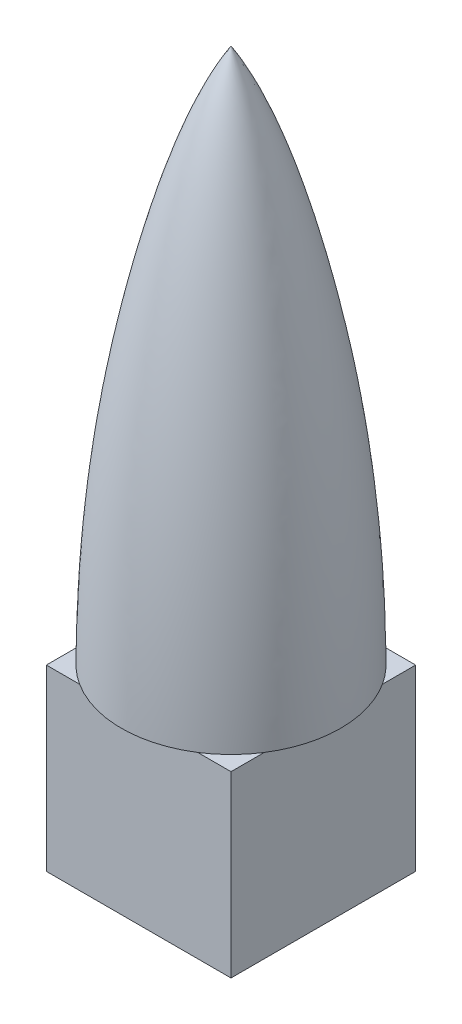
ISO-10303-21;
HEADER;
FILE_DESCRIPTION(('STEP AP214'),'2;1');
FILE_NAME('part.step','',(''),(''),'','','');
FILE_SCHEMA(('AUTOMOTIVE_DESIGN { 1 0 10303 214 1 1 1 1 }'));
ENDSEC;
DATA;
#1=APPLICATION_CONTEXT('core data for automotive mechanical design processes');
#2=APPLICATION_PROTOCOL_DEFINITION('international standard','automotive_design',2000,#1);
#3=PRODUCT_CONTEXT('',#1,'mechanical');
#4=PRODUCT('Part','Part','',(#3));
#5=PRODUCT_RELATED_PRODUCT_CATEGORY('part','',(#4));
#6=PRODUCT_DEFINITION_FORMATION('','',#4);
#7=PRODUCT_DEFINITION_CONTEXT('part definition',#1,'design');
#8=PRODUCT_DEFINITION('design','',#6,#7);
#9=PRODUCT_DEFINITION_SHAPE('','',#8);
#10=(LENGTH_UNIT() NAMED_UNIT(*) SI_UNIT(.MILLI.,.METRE.));
#11=(NAMED_UNIT(*) PLANE_ANGLE_UNIT() SI_UNIT($,.RADIAN.));
#12=(NAMED_UNIT(*) SI_UNIT($,.STERADIAN.) SOLID_ANGLE_UNIT());
#13=UNCERTAINTY_MEASURE_WITH_UNIT(LENGTH_MEASURE(1.E-05),#10,'distance_accuracy_value','');
#14=(GEOMETRIC_REPRESENTATION_CONTEXT(3) GLOBAL_UNCERTAINTY_ASSIGNED_CONTEXT((#13)) GLOBAL_UNIT_ASSIGNED_CONTEXT((#10,
#11,#12)) REPRESENTATION_CONTEXT('',''));
#15=CARTESIAN_POINT('',(0.,0.,0.));
#16=DIRECTION('',(0.,0.,1.));
#17=DIRECTION('',(1.,0.,0.));
#18=AXIS2_PLACEMENT_3D('',#15,#16,#17);
#19=CARTESIAN_POINT('',(0.,15.,0.));
#20=DIRECTION('',(0.,-1.,0.));
#21=DIRECTION('',(0.,0.,-1.));
#22=AXIS2_PLACEMENT_3D('',#19,#20,#21);
#23=PLANE('',#22);
#24=DIRECTION('',(0.,0.,-1.));
#25=VECTOR('',#24,1.);
#26=CARTESIAN_POINT('',(7.75,15.,7.75));
#27=LINE('',#26,#25);
#28=CARTESIAN_POINT('',(7.75,15.,7.75));
#29=VERTEX_POINT('',#28);
#30=CARTESIAN_POINT('',(7.75,15.,4.95756996924902));
#31=VERTEX_POINT('',#30);
#32=EDGE_CURVE('E128',#29,#31,#27,.T.);
#33=ORIENTED_EDGE('',*,*,#32,.T.);
#34=CARTESIAN_POINT('',(0.,15.,0.));
#35=DIRECTION('',(0.,-1.,0.));
#36=DIRECTION('',(1.,0.,0.));
#37=AXIS2_PLACEMENT_3D('',#34,#35,#36);
#38=CIRCLE('',#37,9.19999999999998);
#39=CARTESIAN_POINT('',(4.95756996924902,15.,7.75));
#40=VERTEX_POINT('',#39);
#41=EDGE_CURVE('E118',#31,#40,#38,.T.);
#42=ORIENTED_EDGE('',*,*,#41,.T.);
#43=DIRECTION('',(1.,0.,0.));
#44=VECTOR('',#43,1.);
#45=CARTESIAN_POINT('',(-7.75,15.,7.75));
#46=LINE('',#45,#44);
#47=EDGE_CURVE('E58',#40,#29,#46,.T.);
#48=ORIENTED_EDGE('',*,*,#47,.T.);
#49=EDGE_LOOP('',(#33,#42,#48));
#50=FACE_BOUND('',#49,.T.);
#51=ADVANCED_FACE('F33',(#50),#23,.F.);
#52=CARTESIAN_POINT('',(-7.75,15.,7.75));
#53=VERTEX_POINT('',#52);
#54=CARTESIAN_POINT('',(-4.95756996924901,15.,7.75));
#55=VERTEX_POINT('',#54);
#56=EDGE_CURVE('E145',#53,#55,#46,.T.);
#57=ORIENTED_EDGE('',*,*,#56,.T.);
#58=CARTESIAN_POINT('',(0.,15.,0.));
#59=DIRECTION('',(0.,-1.,0.));
#60=DIRECTION('',(1.,0.,0.));
#61=AXIS2_PLACEMENT_3D('',#58,#59,#60);
#62=CIRCLE('',#61,9.19999999999998);
#63=CARTESIAN_POINT('',(-7.75,15.,4.95756996924901));
#64=VERTEX_POINT('',#63);
#65=EDGE_CURVE('E11',#55,#64,#62,.T.);
#66=ORIENTED_EDGE('',*,*,#65,.T.);
#67=DIRECTION('',(0.,0.,1.));
#68=VECTOR('',#67,1.);
#69=CARTESIAN_POINT('',(-7.75,15.,7.75));
#70=LINE('',#69,#68);
#71=EDGE_CURVE('E172',#64,#53,#70,.T.);
#72=ORIENTED_EDGE('',*,*,#71,.T.);
#73=EDGE_LOOP('',(#57,#66,#72));
#74=FACE_BOUND('',#73,.T.);
#75=ADVANCED_FACE('F209',(#74),#23,.F.);
#76=CARTESIAN_POINT('',(-7.75,15.,-7.75));
#77=VERTEX_POINT('',#76);
#78=CARTESIAN_POINT('',(-7.75,15.,-4.95756996924901));
#79=VERTEX_POINT('',#78);
#80=EDGE_CURVE('E159',#77,#79,#70,.T.);
#81=ORIENTED_EDGE('',*,*,#80,.T.);
#82=CARTESIAN_POINT('',(-4.95756996924901,15.,-7.75));
#83=VERTEX_POINT('',#82);
#84=EDGE_CURVE('E42',#79,#83,#62,.T.);
#85=ORIENTED_EDGE('',*,*,#84,.T.);
#86=DIRECTION('',(-1.,0.,0.));
#87=VECTOR('',#86,1.);
#88=CARTESIAN_POINT('',(-7.75,15.,-7.75));
#89=LINE('',#88,#87);
#90=EDGE_CURVE('E132',#83,#77,#89,.T.);
#91=ORIENTED_EDGE('',*,*,#90,.T.);
#92=EDGE_LOOP('',(#81,#85,#91));
#93=FACE_BOUND('',#92,.T.);
#94=ADVANCED_FACE('F156',(#93),#23,.F.);
#95=CARTESIAN_POINT('',(7.75,15.,7.75));
#96=DIRECTION('',(-1.,0.,0.));
#97=DIRECTION('',(0.,0.,1.));
#98=AXIS2_PLACEMENT_3D('',#95,#96,#97);
#99=PLANE('',#98);
#100=DIRECTION('',(0.,0.,-1.));
#101=VECTOR('',#100,1.);
#102=CARTESIAN_POINT('',(7.75,0.,7.75));
#103=LINE('',#102,#101);
#104=CARTESIAN_POINT('',(7.75,0.,7.75));
#105=VERTEX_POINT('',#104);
#106=CARTESIAN_POINT('',(7.75,0.,-7.75));
#107=VERTEX_POINT('',#106);
#108=EDGE_CURVE('E122',#105,#107,#103,.T.);
#109=ORIENTED_EDGE('',*,*,#108,.T.);
#110=DIRECTION('',(0.,-1.,0.));
#111=VECTOR('',#110,1.);
#112=CARTESIAN_POINT('',(7.75,15.,-7.75));
#113=LINE('',#112,#111);
#114=CARTESIAN_POINT('',(7.75,15.,-7.75));
#115=VERTEX_POINT('',#114);
#116=EDGE_CURVE('E149',#115,#107,#113,.T.);
#117=ORIENTED_EDGE('',*,*,#116,.F.);
#118=CARTESIAN_POINT('',(7.75,15.,-4.95756996924902));
#119=VERTEX_POINT('',#118);
#120=EDGE_CURVE('E88',#119,#115,#27,.T.);
#121=ORIENTED_EDGE('',*,*,#120,.F.);
#122=EDGE_CURVE('E126',#31,#119,#27,.T.);
#123=ORIENTED_EDGE('',*,*,#122,.F.);
#124=ORIENTED_EDGE('',*,*,#32,.F.);
#125=DIRECTION('',(0.,-1.,0.));
#126=VECTOR('',#125,1.);
#127=CARTESIAN_POINT('',(7.75,15.,7.75));
#128=LINE('',#127,#126);
#129=EDGE_CURVE('E142',#29,#105,#128,.T.);
#130=ORIENTED_EDGE('',*,*,#129,.T.);
#131=EDGE_LOOP('',(#109,#117,#121,#123,#124,#130));
#132=FACE_BOUND('',#131,.T.);
#133=ADVANCED_FACE('F35',(#132),#99,.F.);
#134=CARTESIAN_POINT('',(-7.75,15.,-7.75));
#135=DIRECTION('',(0.,0.,1.));
#136=DIRECTION('',(1.,0.,0.));
#137=AXIS2_PLACEMENT_3D('',#134,#135,#136);
#138=PLANE('',#137);
#139=DIRECTION('',(-1.,0.,0.));
#140=VECTOR('',#139,1.);
#141=CARTESIAN_POINT('',(-7.75,0.,-7.75));
#142=LINE('',#141,#140);
#143=CARTESIAN_POINT('',(-7.75,0.,-7.75));
#144=VERTEX_POINT('',#143);
#145=EDGE_CURVE('E138',#107,#144,#142,.T.);
#146=ORIENTED_EDGE('',*,*,#145,.T.);
#147=DIRECTION('',(0.,-1.,0.));
#148=VECTOR('',#147,1.);
#149=CARTESIAN_POINT('',(-7.75,15.,-7.75));
#150=LINE('',#149,#148);
#151=EDGE_CURVE('E147',#77,#144,#150,.T.);
#152=ORIENTED_EDGE('',*,*,#151,.F.);
#153=ORIENTED_EDGE('',*,*,#90,.F.);
#154=CARTESIAN_POINT('',(4.95756996924902,15.,-7.75));
#155=VERTEX_POINT('',#154);
#156=EDGE_CURVE('E133',#155,#83,#89,.T.);
#157=ORIENTED_EDGE('',*,*,#156,.F.);
#158=EDGE_CURVE('E135',#115,#155,#89,.T.);
#159=ORIENTED_EDGE('',*,*,#158,.F.);
#160=ORIENTED_EDGE('',*,*,#116,.T.);
#161=EDGE_LOOP('',(#146,#152,#153,#157,#159,#160));
#162=FACE_BOUND('',#161,.T.);
#163=ADVANCED_FACE('F164',(#162),#138,.F.);
#164=CARTESIAN_POINT('',(-7.75,15.,7.75));
#165=DIRECTION('',(1.,0.,0.));
#166=DIRECTION('',(0.,0.,-1.));
#167=AXIS2_PLACEMENT_3D('',#164,#165,#166);
#168=PLANE('',#167);
#169=DIRECTION('',(0.,0.,1.));
#170=VECTOR('',#169,1.);
#171=CARTESIAN_POINT('',(-7.75,0.,7.75));
#172=LINE('',#171,#170);
#173=CARTESIAN_POINT('',(-7.75,0.,7.75));
#174=VERTEX_POINT('',#173);
#175=EDGE_CURVE('E136',#144,#174,#172,.T.);
#176=ORIENTED_EDGE('',*,*,#175,.T.);
#177=DIRECTION('',(0.,-1.,0.));
#178=VECTOR('',#177,1.);
#179=CARTESIAN_POINT('',(-7.75,15.,7.75));
#180=LINE('',#179,#178);
#181=EDGE_CURVE('E144',#53,#174,#180,.T.);
#182=ORIENTED_EDGE('',*,*,#181,.F.);
#183=ORIENTED_EDGE('',*,*,#71,.F.);
#184=EDGE_CURVE('E170',#79,#64,#70,.T.);
#185=ORIENTED_EDGE('',*,*,#184,.F.);
#186=ORIENTED_EDGE('',*,*,#80,.F.);
#187=ORIENTED_EDGE('',*,*,#151,.T.);
#188=EDGE_LOOP('',(#176,#182,#183,#185,#186,#187));
#189=FACE_BOUND('',#188,.T.);
#190=ADVANCED_FACE('F168',(#189),#168,.F.);
#191=CARTESIAN_POINT('',(-7.75,15.,7.75));
#192=DIRECTION('',(0.,0.,-1.));
#193=DIRECTION('',(-1.,0.,0.));
#194=AXIS2_PLACEMENT_3D('',#191,#192,#193);
#195=PLANE('',#194);
#196=DIRECTION('',(1.,0.,0.));
#197=VECTOR('',#196,1.);
#198=CARTESIAN_POINT('',(-7.75,0.,7.75));
#199=LINE('',#198,#197);
#200=EDGE_CURVE('E80',#174,#105,#199,.T.);
#201=ORIENTED_EDGE('',*,*,#200,.T.);
#202=ORIENTED_EDGE('',*,*,#129,.F.);
#203=ORIENTED_EDGE('',*,*,#47,.F.);
#204=EDGE_CURVE('E173',#55,#40,#46,.T.);
#205=ORIENTED_EDGE('',*,*,#204,.F.);
#206=ORIENTED_EDGE('',*,*,#56,.F.);
#207=ORIENTED_EDGE('',*,*,#181,.T.);
#208=EDGE_LOOP('',(#201,#202,#203,#205,#206,#207));
#209=FACE_BOUND('',#208,.T.);
#210=ADVANCED_FACE('F197',(#209),#195,.F.);
#211=ORIENTED_EDGE('',*,*,#158,.T.);
#212=EDGE_CURVE('E37',#155,#119,#62,.T.);
#213=ORIENTED_EDGE('',*,*,#212,.T.);
#214=ORIENTED_EDGE('',*,*,#120,.T.);
#215=EDGE_LOOP('',(#211,#213,#214));
#216=FACE_BOUND('',#215,.T.);
#217=ADVANCED_FACE('F193',(#216),#23,.F.);
#218=CARTESIAN_POINT('',(0.,0.,0.));
#219=DIRECTION('',(0.,-1.,0.));
#220=DIRECTION('',(0.,0.,-1.));
#221=AXIS2_PLACEMENT_3D('',#218,#219,#220);
#222=PLANE('',#221);
#223=ORIENTED_EDGE('',*,*,#108,.F.);
#224=ORIENTED_EDGE('',*,*,#200,.F.);
#225=ORIENTED_EDGE('',*,*,#175,.F.);
#226=ORIENTED_EDGE('',*,*,#145,.F.);
#227=EDGE_LOOP('',(#223,#224,#225,#226));
#228=FACE_BOUND('',#227,.T.);
#229=ADVANCED_FACE('F196',(#228),#222,.T.);
#230=CARTESIAN_POINT('',(9.19999999999999,15.,0.));
#231=DIRECTION('',(0.,-1.,0.));
#232=DIRECTION('',(1.,0.,0.));
#233=AXIS2_PLACEMENT_3D('',#230,#231,#232);
#234=PLANE('',#233);
#235=ORIENTED_EDGE('',*,*,#122,.T.);
#236=EDGE_CURVE('E49',#119,#31,#38,.T.);
#237=ORIENTED_EDGE('',*,*,#236,.T.);
#238=EDGE_LOOP('',(#235,#237));
#239=FACE_BOUND('',#238,.T.);
#240=ADVANCED_FACE('F192',(#239),#234,.T.);
#241=ORIENTED_EDGE('',*,*,#156,.T.);
#242=EDGE_CURVE('E181',#83,#155,#38,.T.);
#243=ORIENTED_EDGE('',*,*,#242,.T.);
#244=EDGE_LOOP('',(#241,#243));
#245=FACE_BOUND('',#244,.T.);
#246=ADVANCED_FACE('F180',(#245),#234,.T.);
#247=ORIENTED_EDGE('',*,*,#184,.T.);
#248=EDGE_CURVE('E182',#64,#79,#38,.T.);
#249=ORIENTED_EDGE('',*,*,#248,.T.);
#250=EDGE_LOOP('',(#247,#249));
#251=FACE_BOUND('',#250,.T.);
#252=ADVANCED_FACE('F222',(#251),#234,.T.);
#253=ORIENTED_EDGE('',*,*,#204,.T.);
#254=EDGE_CURVE('E121',#40,#55,#38,.T.);
#255=ORIENTED_EDGE('',*,*,#254,.T.);
#256=EDGE_LOOP('',(#253,#255));
#257=FACE_BOUND('',#256,.T.);
#258=ADVANCED_FACE('F115',(#257),#234,.T.);
#259=CARTESIAN_POINT('',(9.19999999999999,15.,0.));
#260=CARTESIAN_POINT('',(9.15224899524364,24.6909873660194,0.));
#261=CARTESIAN_POINT('',(8.00981736964998,34.8825172622735,0.));
#262=CARTESIAN_POINT('',(4.24723586984686,50.5068159575728,0.));
#263=CARTESIAN_POINT('',(2.01677807120108,56.805895623584,0.));
#264=CARTESIAN_POINT('',(0.,60.,0.));
#265=B_SPLINE_CURVE_WITH_KNOTS('',3,(#259,#260,#261,#262,#263,#264),.UNSPECIFIED.,.F.,.F.,(4,1,
1,4),(0.,0.565414982236912,0.665414982236912,1.),.UNSPECIFIED.);
#266=CARTESIAN_POINT('',(0.,15.,0.));
#267=DIRECTION('',(0.,-1.,0.));
#268=AXIS1_PLACEMENT('',#266,#267);
#269=SURFACE_OF_REVOLUTION('',#265,#268);
#270=CARTESIAN_POINT('',(0.,60.,0.));
#271=VERTEX_POINT('',#270);
#272=VERTEX_LOOP('',#271);
#273=FACE_BOUND('',#272,.T.);
#274=ORIENTED_EDGE('',*,*,#41,.F.);
#275=ORIENTED_EDGE('',*,*,#236,.F.);
#276=ORIENTED_EDGE('',*,*,#212,.F.);
#277=ORIENTED_EDGE('',*,*,#242,.F.);
#278=ORIENTED_EDGE('',*,*,#84,.F.);
#279=ORIENTED_EDGE('',*,*,#248,.F.);
#280=ORIENTED_EDGE('',*,*,#65,.F.);
#281=ORIENTED_EDGE('',*,*,#254,.F.);
#282=EDGE_LOOP('',(#274,#275,#276,#277,#278,#279,#280,#281));
#283=FACE_BOUND('',#282,.T.);
#284=ADVANCED_FACE('F113',(#273,#283),#269,.F.);
#285=CLOSED_SHELL('',(#51,#75,#94,#133,#163,#190,#210,#217,#229,#240,#246,#252,#258,#284));
#286=MANIFOLD_SOLID_BREP('B2',#285);
#287=ADVANCED_BREP_SHAPE_REPRESENTATION('',(#18,#286),#14);
#288=SHAPE_DEFINITION_REPRESENTATION(#9,#287);
ENDSEC;
END-ISO-10303-21;
